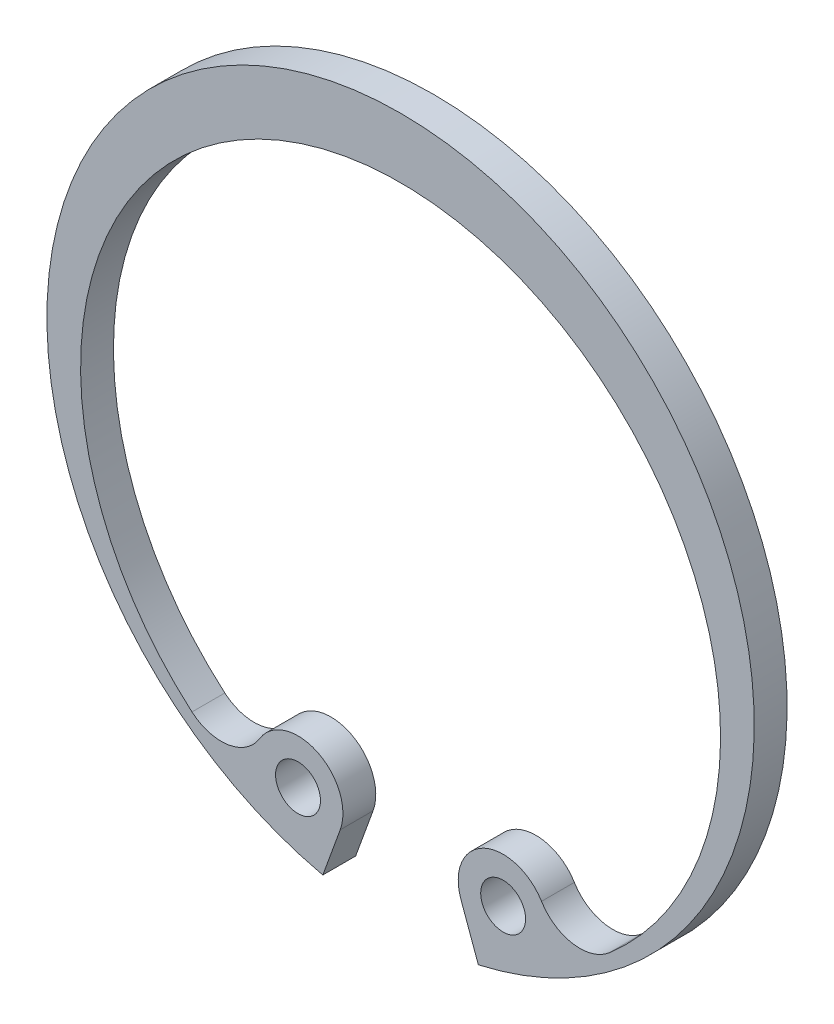
ISO-10303-21;
HEADER;
FILE_DESCRIPTION(('STEP AP214'),'2;1');
FILE_NAME('part.step','',(''),(''),'','','');
FILE_SCHEMA(('AUTOMOTIVE_DESIGN { 1 0 10303 214 1 1 1 1 }'));
ENDSEC;
DATA;
#1=APPLICATION_CONTEXT('core data for automotive mechanical design processes');
#2=APPLICATION_PROTOCOL_DEFINITION('international standard','automotive_design',2000,#1);
#3=PRODUCT_CONTEXT('',#1,'mechanical');
#4=PRODUCT('Part','Part','',(#3));
#5=PRODUCT_RELATED_PRODUCT_CATEGORY('part','',(#4));
#6=PRODUCT_DEFINITION_FORMATION('','',#4);
#7=PRODUCT_DEFINITION_CONTEXT('part definition',#1,'design');
#8=PRODUCT_DEFINITION('design','',#6,#7);
#9=PRODUCT_DEFINITION_SHAPE('','',#8);
#10=(LENGTH_UNIT() NAMED_UNIT(*) SI_UNIT(.MILLI.,.METRE.));
#11=(NAMED_UNIT(*) PLANE_ANGLE_UNIT() SI_UNIT($,.RADIAN.));
#12=(NAMED_UNIT(*) SI_UNIT($,.STERADIAN.) SOLID_ANGLE_UNIT());
#13=UNCERTAINTY_MEASURE_WITH_UNIT(LENGTH_MEASURE(1.E-05),#10,'distance_accuracy_value','');
#14=(GEOMETRIC_REPRESENTATION_CONTEXT(3) GLOBAL_UNCERTAINTY_ASSIGNED_CONTEXT((#13)) GLOBAL_UNIT_ASSIGNED_CONTEXT((#10,
#11,#12)) REPRESENTATION_CONTEXT('',''));
#15=CARTESIAN_POINT('',(0.,0.,0.));
#16=DIRECTION('',(0.,0.,1.));
#17=DIRECTION('',(1.,0.,0.));
#18=AXIS2_PLACEMENT_3D('',#15,#16,#17);
#19=CARTESIAN_POINT('',(0.,0.,1.95));
#20=DIRECTION('',(0.,0.,1.));
#21=DIRECTION('',(1.,0.,0.));
#22=AXIS2_PLACEMENT_3D('',#19,#20,#21);
#23=PLANE('',#22);
#24=CARTESIAN_POINT('',(-3.04471087596,-8.36527438047,1.95));
#25=DIRECTION('',(0.,0.,-1.));
#26=DIRECTION('',(-1.,0.,0.));
#27=AXIS2_PLACEMENT_3D('',#24,#25,#26);
#28=CIRCLE('',#27,0.666666666667);
#29=CARTESIAN_POINT('',(-3.711377542627,-8.36527438047,1.95));
#30=VERTEX_POINT('',#29);
#31=EDGE_CURVE('E127',#30,#30,#28,.T.);
#32=ORIENTED_EDGE('',*,*,#31,.T.);
#33=EDGE_LOOP('',(#32));
#34=FACE_BOUND('',#33,.T.);
#35=CARTESIAN_POINT('',(3.04471087596,-8.36527438047,1.95));
#36=DIRECTION('',(0.,0.,-1.));
#37=DIRECTION('',(-1.,0.,0.));
#38=AXIS2_PLACEMENT_3D('',#35,#36,#37);
#39=CIRCLE('',#38,0.666666666667);
#40=CARTESIAN_POINT('',(2.378044209293,-8.36527438047,1.95));
#41=VERTEX_POINT('',#40);
#42=EDGE_CURVE('E124',#41,#41,#39,.T.);
#43=ORIENTED_EDGE('',*,*,#42,.T.);
#44=EDGE_LOOP('',(#43));
#45=FACE_BOUND('',#44,.T.);
#46=CARTESIAN_POINT('',(3.04471087596,-8.36527438047,1.95));
#47=DIRECTION('',(0.,0.,-1.));
#48=DIRECTION('',(-1.,0.,0.));
#49=AXIS2_PLACEMENT_3D('',#46,#47,#48);
#50=CIRCLE('',#49,1.33333333333);
#51=CARTESIAN_POINT('',(1.79178738158102,-8.82130123823838,1.95));
#52=VERTEX_POINT('',#51);
#53=CARTESIAN_POINT('',(4.18415582842848,-7.6728561700794,1.95));
#54=VERTEX_POINT('',#53);
#55=EDGE_CURVE('E140',#52,#54,#50,.T.);
#56=ORIENTED_EDGE('',*,*,#55,.F.);
#57=DIRECTION('',(-0.342020143325932,0.939692620785813,0.));
#58=VECTOR('',#57,1.);
#59=CARTESIAN_POINT('',(1.79178738158,-8.82130123824,1.95));
#60=LINE('',#59,#58);
#61=CARTESIAN_POINT('',(2.30921625273277,-10.2429253779049,1.949999999815));
#62=VERTEX_POINT('',#61);
#63=EDGE_CURVE('E79',#52,#62,#60,.F.);
#64=ORIENTED_EDGE('',*,*,#63,.T.);
#65=CARTESIAN_POINT('',(0.,0.,1.94999999963));
#66=DIRECTION('',(0.,0.,-1.));
#67=DIRECTION('',(-1.,0.,0.));
#68=AXIS2_PLACEMENT_3D('',#65,#66,#67);
#69=CIRCLE('',#68,10.5);
#70=CARTESIAN_POINT('',(-2.30921625275207,-10.2429253779389,1.94999999963));
#71=VERTEX_POINT('',#70);
#72=EDGE_CURVE('E20',#71,#62,#69,.T.);
#73=ORIENTED_EDGE('',*,*,#72,.F.);
#74=DIRECTION('',(-0.342020143325932,-0.939692620785813,0.));
#75=VECTOR('',#74,1.);
#76=CARTESIAN_POINT('',(-1.79178738158,-8.82130123824,1.94999999963));
#77=LINE('',#76,#75);
#78=CARTESIAN_POINT('',(-1.7917873816772,-8.82130123850485,1.949999999815));
#79=VERTEX_POINT('',#78);
#80=EDGE_CURVE('E82',#71,#79,#77,.F.);
#81=ORIENTED_EDGE('',*,*,#80,.T.);
#82=CARTESIAN_POINT('',(-3.04471087596,-8.36527438047,1.95));
#83=DIRECTION('',(0.,0.,-1.));
#84=DIRECTION('',(-1.,0.,0.));
#85=AXIS2_PLACEMENT_3D('',#82,#83,#84);
#86=CIRCLE('',#85,1.33333333333);
#87=CARTESIAN_POINT('',(-4.18415582842567,-7.67285617008111,1.95));
#88=VERTEX_POINT('',#87);
#89=EDGE_CURVE('E130',#88,#79,#86,.T.);
#90=ORIENTED_EDGE('',*,*,#89,.F.);
#91=CARTESIAN_POINT('',(-5.32360078089,-6.98043795969,1.95));
#92=DIRECTION('',(0.,0.,-1.));
#93=DIRECTION('',(-1.,0.,0.));
#94=AXIS2_PLACEMENT_3D('',#91,#92,#93);
#95=CIRCLE('',#94,1.33333333333);
#96=CARTESIAN_POINT('',(-6.1927600920539,-7.99154619800377,1.95));
#97=VERTEX_POINT('',#96);
#98=EDGE_CURVE('E132',#88,#97,#95,.T.);
#99=ORIENTED_EDGE('',*,*,#98,.T.);
#100=CARTESIAN_POINT('',(0.,-0.7874,1.95));
#101=DIRECTION('',(0.,0.,-1.));
#102=DIRECTION('',(-1.,0.,0.));
#103=AXIS2_PLACEMENT_3D('',#100,#101,#102);
#104=CIRCLE('',#103,9.5);
#105=CARTESIAN_POINT('',(6.1927600920548,-7.99154619800481,1.95));
#106=VERTEX_POINT('',#105);
#107=EDGE_CURVE('E135',#97,#106,#104,.T.);
#108=ORIENTED_EDGE('',*,*,#107,.T.);
#109=CARTESIAN_POINT('',(5.32360078089,-6.98043795969,1.95));
#110=DIRECTION('',(0.,0.,-1.));
#111=DIRECTION('',(-1.,0.,0.));
#112=AXIS2_PLACEMENT_3D('',#109,#110,#111);
#113=CIRCLE('',#112,1.33333333333);
#114=EDGE_CURVE('E138',#106,#54,#113,.T.);
#115=ORIENTED_EDGE('',*,*,#114,.T.);
#116=EDGE_LOOP('',(#56,#64,#73,#81,#90,#99,#108,#115));
#117=FACE_BOUND('',#116,.T.);
#118=ADVANCED_FACE('F17',(#34,#45,#117),#23,.T.);
#119=CARTESIAN_POINT('',(-1.79178738158,-8.82130123824,1.95));
#120=DIRECTION('',(-0.939692620785813,0.342020143325932,0.));
#121=DIRECTION('',(-0.342020143325932,-0.939692620785813,0.));
#122=AXIS2_PLACEMENT_3D('',#119,#120,#121);
#123=PLANE('',#122);
#124=DIRECTION('',(0.,0.,-1.));
#125=VECTOR('',#124,1.);
#126=CARTESIAN_POINT('',(-1.79178738177663,-8.82130123877137,1.95));
#127=LINE('',#126,#125);
#128=CARTESIAN_POINT('',(-1.7917873816799,-8.82130123851224,0.9750000001865));
#129=VERTEX_POINT('',#128);
#130=EDGE_CURVE('E94',#79,#129,#127,.T.);
#131=ORIENTED_EDGE('',*,*,#130,.F.);
#132=ORIENTED_EDGE('',*,*,#80,.F.);
#133=DIRECTION('',(0.,0.,-1.));
#134=VECTOR('',#133,1.);
#135=CARTESIAN_POINT('',(-2.30921625275845,-10.2429253779375,0.975));
#136=LINE('',#135,#134);
#137=CARTESIAN_POINT('',(-2.30921625276085,-10.242925377937,0.975));
#138=VERTEX_POINT('',#137);
#139=EDGE_CURVE('E88',#138,#71,#136,.F.);
#140=ORIENTED_EDGE('',*,*,#139,.F.);
#141=DIRECTION('',(-0.342020143337028,-0.939692620781774,0.));
#142=VECTOR('',#141,1.);
#143=CARTESIAN_POINT('',(-1.79178738158,-8.82130123824,0.975));
#144=LINE('',#143,#142);
#145=EDGE_CURVE('E123',#129,#138,#144,.T.);
#146=ORIENTED_EDGE('',*,*,#145,.F.);
#147=EDGE_LOOP('',(#131,#132,#140,#146));
#148=FACE_BOUND('',#147,.T.);
#149=ADVANCED_FACE('F90',(#148),#123,.F.);
#150=CARTESIAN_POINT('',(0.,0.,0.975));
#151=DIRECTION('',(0.,0.,-1.));
#152=DIRECTION('',(-1.,0.,0.));
#153=AXIS2_PLACEMENT_3D('',#150,#151,#152);
#154=CYLINDRICAL_SURFACE('',#153,10.5);
#155=DIRECTION('',(0.,0.,1.));
#156=VECTOR('',#155,1.);
#157=CARTESIAN_POINT('',(2.30921625271985,-10.2429253778694,1.95));
#158=LINE('',#157,#156);
#159=CARTESIAN_POINT('',(2.30921625274155,-10.2429253779029,0.975));
#160=VERTEX_POINT('',#159);
#161=EDGE_CURVE('E102',#62,#160,#158,.F.);
#162=ORIENTED_EDGE('',*,*,#161,.T.);
#163=CARTESIAN_POINT('',(0.,0.,0.975));
#164=DIRECTION('',(0.,0.,-1.));
#165=DIRECTION('',(-1.,0.,0.));
#166=AXIS2_PLACEMENT_3D('',#163,#164,#165);
#167=CIRCLE('',#166,10.5);
#168=EDGE_CURVE('E98',#138,#160,#167,.T.);
#169=ORIENTED_EDGE('',*,*,#168,.F.);
#170=ORIENTED_EDGE('',*,*,#139,.T.);
#171=ORIENTED_EDGE('',*,*,#72,.T.);
#172=EDGE_LOOP('',(#162,#169,#170,#171));
#173=FACE_BOUND('',#172,.T.);
#174=ADVANCED_FACE('F97',(#173),#154,.T.);
#175=CARTESIAN_POINT('',(1.79178738158,-8.82130123824,1.95));
#176=DIRECTION('',(0.939692620785813,0.342020143325932,0.));
#177=DIRECTION('',(-0.342020143325932,0.939692620785813,0.));
#178=AXIS2_PLACEMENT_3D('',#175,#176,#177);
#179=PLANE('',#178);
#180=ORIENTED_EDGE('',*,*,#161,.F.);
#181=ORIENTED_EDGE('',*,*,#63,.F.);
#182=DIRECTION('',(0.,0.,-1.));
#183=VECTOR('',#182,1.);
#184=CARTESIAN_POINT('',(1.79178738158285,-8.82130123823896,1.95));
#185=LINE('',#184,#183);
#186=CARTESIAN_POINT('',(1.79178738158301,-8.82130123824604,0.9750000001865));
#187=VERTEX_POINT('',#186);
#188=EDGE_CURVE('E142',#187,#52,#185,.F.);
#189=ORIENTED_EDGE('',*,*,#188,.F.);
#190=DIRECTION('',(-0.342020143337028,0.939692620781774,0.));
#191=VECTOR('',#190,1.);
#192=CARTESIAN_POINT('',(2.30921625275,-10.2429253779,0.975));
#193=LINE('',#192,#191);
#194=EDGE_CURVE('E121',#160,#187,#193,.T.);
#195=ORIENTED_EDGE('',*,*,#194,.F.);
#196=EDGE_LOOP('',(#180,#181,#189,#195));
#197=FACE_BOUND('',#196,.T.);
#198=ADVANCED_FACE('F161',(#197),#179,.F.);
#199=CARTESIAN_POINT('',(3.04471087596,-8.36527438047,1.95));
#200=DIRECTION('',(0.,0.,-1.));
#201=DIRECTION('',(-1.,0.,0.));
#202=AXIS2_PLACEMENT_3D('',#199,#200,#201);
#203=CYLINDRICAL_SURFACE('',#202,1.33333333333);
#204=DIRECTION('',(0.,0.,-1.));
#205=VECTOR('',#204,1.);
#206=CARTESIAN_POINT('',(4.18415582842916,-7.67285617008051,1.95));
#207=LINE('',#206,#205);
#208=CARTESIAN_POINT('',(4.18415582842848,-7.6728561700794,0.975000000373));
#209=VERTEX_POINT('',#208);
#210=EDGE_CURVE('E139',#54,#209,#207,.T.);
#211=ORIENTED_EDGE('',*,*,#210,.T.);
#212=CARTESIAN_POINT('',(3.04471087596,-8.36527438047,0.975000000373));
#213=DIRECTION('',(0.,0.,-1.));
#214=DIRECTION('',(-1.,0.,0.));
#215=AXIS2_PLACEMENT_3D('',#212,#213,#214);
#216=CIRCLE('',#215,1.33333333333);
#217=EDGE_CURVE('E119',#187,#209,#216,.T.);
#218=ORIENTED_EDGE('',*,*,#217,.F.);
#219=ORIENTED_EDGE('',*,*,#188,.T.);
#220=ORIENTED_EDGE('',*,*,#55,.T.);
#221=EDGE_LOOP('',(#211,#218,#219,#220));
#222=FACE_BOUND('',#221,.T.);
#223=ADVANCED_FACE('F162',(#222),#203,.T.);
#224=CARTESIAN_POINT('',(5.32360078089,-6.98043795969,1.95));
#225=DIRECTION('',(0.,0.,-1.));
#226=DIRECTION('',(-1.,0.,0.));
#227=AXIS2_PLACEMENT_3D('',#224,#225,#226);
#228=CYLINDRICAL_SURFACE('',#227,1.33333333333);
#229=ORIENTED_EDGE('',*,*,#210,.F.);
#230=ORIENTED_EDGE('',*,*,#114,.F.);
#231=DIRECTION('',(0.,0.,-1.));
#232=VECTOR('',#231,1.);
#233=CARTESIAN_POINT('',(6.19276009205613,-7.99154619800549,1.95));
#234=LINE('',#233,#232);
#235=CARTESIAN_POINT('',(6.1927600920557,-7.99154619800586,0.975000000373));
#236=VERTEX_POINT('',#235);
#237=EDGE_CURVE('E137',#106,#236,#234,.T.);
#238=ORIENTED_EDGE('',*,*,#237,.T.);
#239=CARTESIAN_POINT('',(5.32360078089,-6.98043795969,0.975000000373));
#240=DIRECTION('',(0.,0.,-1.));
#241=DIRECTION('',(-1.,0.,0.));
#242=AXIS2_PLACEMENT_3D('',#239,#240,#241);
#243=CIRCLE('',#242,1.33333333333);
#244=EDGE_CURVE('E116',#209,#236,#243,.F.);
#245=ORIENTED_EDGE('',*,*,#244,.F.);
#246=EDGE_LOOP('',(#229,#230,#238,#245));
#247=FACE_BOUND('',#246,.T.);
#248=ADVANCED_FACE('F166',(#247),#228,.F.);
#249=CARTESIAN_POINT('',(0.,-0.7874,1.95));
#250=DIRECTION('',(0.,0.,-1.));
#251=DIRECTION('',(-1.,0.,0.));
#252=AXIS2_PLACEMENT_3D('',#249,#250,#251);
#253=CYLINDRICAL_SURFACE('',#252,9.5);
#254=ORIENTED_EDGE('',*,*,#107,.F.);
#255=DIRECTION('',(0.,0.,-1.));
#256=VECTOR('',#255,1.);
#257=CARTESIAN_POINT('',(-6.19276009205433,-7.9915461980034,1.95));
#258=LINE('',#257,#256);
#259=CARTESIAN_POINT('',(-6.1927600920539,-7.99154619800377,0.975000000373));
#260=VERTEX_POINT('',#259);
#261=EDGE_CURVE('E134',#97,#260,#258,.T.);
#262=ORIENTED_EDGE('',*,*,#261,.T.);
#263=CARTESIAN_POINT('',(0.,-0.7874,0.975000000373));
#264=DIRECTION('',(0.,0.,-1.));
#265=DIRECTION('',(-1.,0.,0.));
#266=AXIS2_PLACEMENT_3D('',#263,#264,#265);
#267=CIRCLE('',#266,9.5);
#268=EDGE_CURVE('E114',#236,#260,#267,.F.);
#269=ORIENTED_EDGE('',*,*,#268,.F.);
#270=ORIENTED_EDGE('',*,*,#237,.F.);
#271=EDGE_LOOP('',(#254,#262,#269,#270));
#272=FACE_BOUND('',#271,.T.);
#273=ADVANCED_FACE('F172',(#272),#253,.F.);
#274=CARTESIAN_POINT('',(-5.32360078089,-6.98043795969,1.95));
#275=DIRECTION('',(0.,0.,-1.));
#276=DIRECTION('',(-1.,0.,0.));
#277=AXIS2_PLACEMENT_3D('',#274,#275,#276);
#278=CYLINDRICAL_SURFACE('',#277,1.33333333333);
#279=ORIENTED_EDGE('',*,*,#261,.F.);
#280=ORIENTED_EDGE('',*,*,#98,.F.);
#281=DIRECTION('',(0.,0.,-1.));
#282=VECTOR('',#281,1.);
#283=CARTESIAN_POINT('',(-4.18415582842354,-7.67285617008393,1.95));
#284=LINE('',#283,#282);
#285=CARTESIAN_POINT('',(-4.18415582842354,-7.67285617008393,0.9750000001865));
#286=VERTEX_POINT('',#285);
#287=EDGE_CURVE('E35',#286,#88,#284,.F.);
#288=ORIENTED_EDGE('',*,*,#287,.F.);
#289=CARTESIAN_POINT('',(-5.32360078089,-6.98043795969,0.975000000373));
#290=DIRECTION('',(0.,0.,-1.));
#291=DIRECTION('',(-1.,0.,0.));
#292=AXIS2_PLACEMENT_3D('',#289,#290,#291);
#293=CIRCLE('',#292,1.33333333333);
#294=EDGE_CURVE('E111',#260,#286,#293,.F.);
#295=ORIENTED_EDGE('',*,*,#294,.F.);
#296=EDGE_LOOP('',(#279,#280,#288,#295));
#297=FACE_BOUND('',#296,.T.);
#298=ADVANCED_FACE('F173',(#297),#278,.F.);
#299=CARTESIAN_POINT('',(-3.04471087596,-8.36527438047,1.95));
#300=DIRECTION('',(0.,0.,-1.));
#301=DIRECTION('',(-1.,0.,0.));
#302=AXIS2_PLACEMENT_3D('',#299,#300,#301);
#303=CYLINDRICAL_SURFACE('',#302,1.33333333333);
#304=ORIENTED_EDGE('',*,*,#130,.T.);
#305=CARTESIAN_POINT('',(-3.04471087596,-8.36527438047,0.975));
#306=DIRECTION('',(0.,0.,-1.));
#307=DIRECTION('',(-1.,0.,0.));
#308=AXIS2_PLACEMENT_3D('',#305,#306,#307);
#309=CIRCLE('',#308,1.33333333333);
#310=EDGE_CURVE('E108',#286,#129,#309,.T.);
#311=ORIENTED_EDGE('',*,*,#310,.F.);
#312=ORIENTED_EDGE('',*,*,#287,.T.);
#313=ORIENTED_EDGE('',*,*,#89,.T.);
#314=EDGE_LOOP('',(#304,#311,#312,#313));
#315=FACE_BOUND('',#314,.T.);
#316=ADVANCED_FACE('F175',(#315),#303,.T.);
#317=CARTESIAN_POINT('',(-3.04471087596,-8.36527438047,1.95));
#318=DIRECTION('',(0.,0.,-1.));
#319=DIRECTION('',(-1.,0.,0.));
#320=AXIS2_PLACEMENT_3D('',#317,#318,#319);
#321=CYLINDRICAL_SURFACE('',#320,0.666666666667);
#322=CARTESIAN_POINT('',(-3.04471087596,-8.36527438047,0.975));
#323=DIRECTION('',(0.,0.,-1.));
#324=DIRECTION('',(-1.,0.,0.));
#325=AXIS2_PLACEMENT_3D('',#322,#323,#324);
#326=CIRCLE('',#325,0.666666666667);
#327=CARTESIAN_POINT('',(-3.711377542627,-8.36527438047,0.975));
#328=VERTEX_POINT('',#327);
#329=EDGE_CURVE('E26',#328,#328,#326,.F.);
#330=ORIENTED_EDGE('',*,*,#329,.F.);
#331=EDGE_LOOP('',(#330));
#332=FACE_BOUND('',#331,.T.);
#333=ORIENTED_EDGE('',*,*,#31,.F.);
#334=EDGE_LOOP('',(#333));
#335=FACE_BOUND('',#334,.T.);
#336=ADVANCED_FACE('F182',(#332,#335),#321,.F.);
#337=CARTESIAN_POINT('',(3.04471087596,-8.36527438047,1.95));
#338=DIRECTION('',(0.,0.,-1.));
#339=DIRECTION('',(-1.,0.,0.));
#340=AXIS2_PLACEMENT_3D('',#337,#338,#339);
#341=CYLINDRICAL_SURFACE('',#340,0.666666666667);
#342=CARTESIAN_POINT('',(3.04471087596,-8.36527438047,0.975));
#343=DIRECTION('',(0.,0.,-1.));
#344=DIRECTION('',(-1.,0.,0.));
#345=AXIS2_PLACEMENT_3D('',#342,#343,#344);
#346=CIRCLE('',#345,0.666666666667);
#347=CARTESIAN_POINT('',(2.378044209293,-8.36527438047,0.975));
#348=VERTEX_POINT('',#347);
#349=EDGE_CURVE('E11',#348,#348,#346,.F.);
#350=ORIENTED_EDGE('',*,*,#349,.F.);
#351=EDGE_LOOP('',(#350));
#352=FACE_BOUND('',#351,.T.);
#353=ORIENTED_EDGE('',*,*,#42,.F.);
#354=EDGE_LOOP('',(#353));
#355=FACE_BOUND('',#354,.T.);
#356=ADVANCED_FACE('F187',(#352,#355),#341,.F.);
#357=CARTESIAN_POINT('',(0.,0.,0.975));
#358=DIRECTION('',(0.,0.,-1.));
#359=DIRECTION('',(-1.,0.,0.));
#360=AXIS2_PLACEMENT_3D('',#357,#358,#359);
#361=PLANE('',#360);
#362=ORIENTED_EDGE('',*,*,#349,.T.);
#363=EDGE_LOOP('',(#362));
#364=FACE_BOUND('',#363,.T.);
#365=ORIENTED_EDGE('',*,*,#329,.T.);
#366=EDGE_LOOP('',(#365));
#367=FACE_BOUND('',#366,.T.);
#368=ORIENTED_EDGE('',*,*,#310,.T.);
#369=ORIENTED_EDGE('',*,*,#145,.T.);
#370=ORIENTED_EDGE('',*,*,#168,.T.);
#371=ORIENTED_EDGE('',*,*,#194,.T.);
#372=ORIENTED_EDGE('',*,*,#217,.T.);
#373=ORIENTED_EDGE('',*,*,#244,.T.);
#374=ORIENTED_EDGE('',*,*,#268,.T.);
#375=ORIENTED_EDGE('',*,*,#294,.T.);
#376=EDGE_LOOP('',(#368,#369,#370,#371,#372,#373,#374,#375));
#377=FACE_BOUND('',#376,.T.);
#378=ADVANCED_FACE('F159',(#364,#367,#377),#361,.T.);
#379=CLOSED_SHELL('',(#118,#149,#174,#198,#223,#248,#273,#298,#316,#336,#356,#378));
#380=MANIFOLD_SOLID_BREP('B1',#379);
#381=ADVANCED_BREP_SHAPE_REPRESENTATION('',(#18,#380),#14);
#382=SHAPE_DEFINITION_REPRESENTATION(#9,#381);
ENDSEC;
END-ISO-10303-21;
